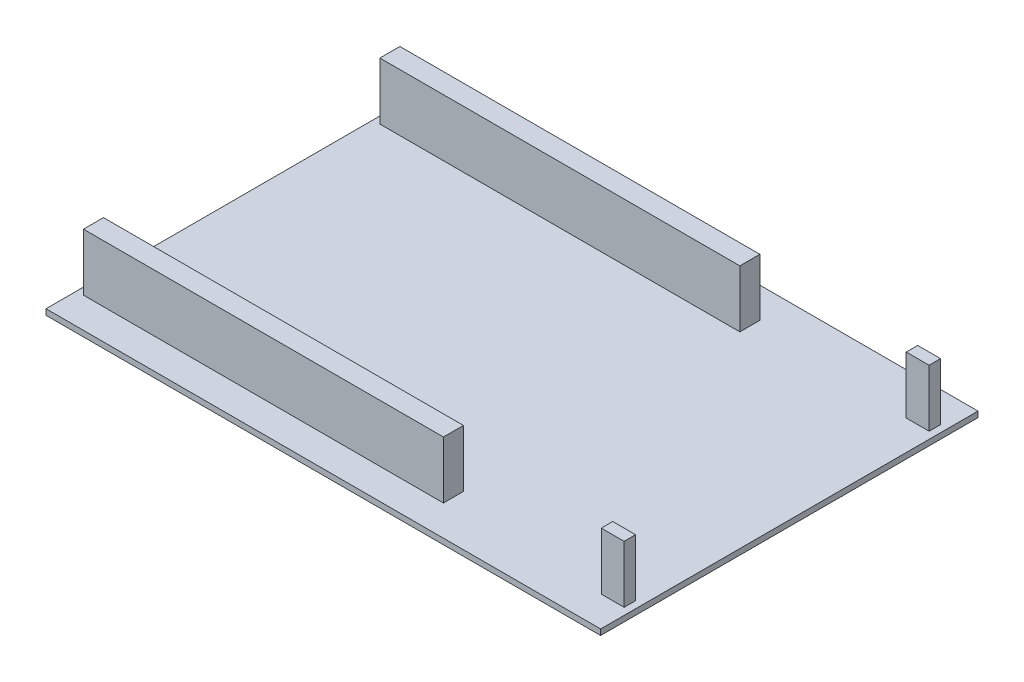
ISO-10303-21;
HEADER;
FILE_DESCRIPTION(('STEP AP214'),'2;1');
FILE_NAME('part.step','',(''),(''),'','','');
FILE_SCHEMA(('AUTOMOTIVE_DESIGN { 1 0 10303 214 1 1 1 1 }'));
ENDSEC;
DATA;
#1=APPLICATION_CONTEXT('core data for automotive mechanical design processes');
#2=APPLICATION_PROTOCOL_DEFINITION('international standard','automotive_design',2000,#1);
#3=PRODUCT_CONTEXT('',#1,'mechanical');
#4=PRODUCT('Part','Part','',(#3));
#5=PRODUCT_RELATED_PRODUCT_CATEGORY('part','',(#4));
#6=PRODUCT_DEFINITION_FORMATION('','',#4);
#7=PRODUCT_DEFINITION_CONTEXT('part definition',#1,'design');
#8=PRODUCT_DEFINITION('design','',#6,#7);
#9=PRODUCT_DEFINITION_SHAPE('','',#8);
#10=(LENGTH_UNIT() NAMED_UNIT(*) SI_UNIT(.MILLI.,.METRE.));
#11=(NAMED_UNIT(*) PLANE_ANGLE_UNIT() SI_UNIT($,.RADIAN.));
#12=(NAMED_UNIT(*) SI_UNIT($,.STERADIAN.) SOLID_ANGLE_UNIT());
#13=UNCERTAINTY_MEASURE_WITH_UNIT(LENGTH_MEASURE(1.E-05),#10,'distance_accuracy_value','');
#14=(GEOMETRIC_REPRESENTATION_CONTEXT(3) GLOBAL_UNCERTAINTY_ASSIGNED_CONTEXT((#13)) GLOBAL_UNIT_ASSIGNED_CONTEXT((#10,
#11,#12)) REPRESENTATION_CONTEXT('',''));
#15=CARTESIAN_POINT('',(0.,0.,0.));
#16=DIRECTION('',(0.,0.,1.));
#17=DIRECTION('',(1.,0.,0.));
#18=AXIS2_PLACEMENT_3D('',#15,#16,#17);
#19=CARTESIAN_POINT('',(0.,1.,0.));
#20=DIRECTION('',(0.,-1.,0.));
#21=DIRECTION('',(0.,0.,-1.));
#22=AXIS2_PLACEMENT_3D('',#19,#20,#21);
#23=PLANE('',#22);
#24=DIRECTION('',(0.,0.,1.));
#25=VECTOR('',#24,1.);
#26=CARTESIAN_POINT('',(43.28,1.,-27.67));
#27=LINE('',#26,#25);
#28=CARTESIAN_POINT('',(43.28,1.,-27.67));
#29=VERTEX_POINT('',#28);
#30=CARTESIAN_POINT('',(43.28,1.,-25.67));
#31=VERTEX_POINT('',#30);
#32=EDGE_CURVE('E227',#29,#31,#27,.T.);
#33=ORIENTED_EDGE('',*,*,#32,.F.);
#34=DIRECTION('',(-1.,0.,0.));
#35=VECTOR('',#34,1.);
#36=CARTESIAN_POINT('',(47.28,1.,-27.67));
#37=LINE('',#36,#35);
#38=CARTESIAN_POINT('',(47.28,1.,-27.67));
#39=VERTEX_POINT('',#38);
#40=EDGE_CURVE('E240',#39,#29,#37,.T.);
#41=ORIENTED_EDGE('',*,*,#40,.F.);
#42=DIRECTION('',(0.,0.,-1.));
#43=VECTOR('',#42,1.);
#44=CARTESIAN_POINT('',(47.28,1.,-27.67));
#45=LINE('',#44,#43);
#46=CARTESIAN_POINT('',(47.28,1.,-25.67));
#47=VERTEX_POINT('',#46);
#48=EDGE_CURVE('E249',#47,#39,#45,.T.);
#49=ORIENTED_EDGE('',*,*,#48,.F.);
#50=DIRECTION('',(1.,0.,0.));
#51=VECTOR('',#50,1.);
#52=CARTESIAN_POINT('',(47.28,1.,-25.67));
#53=LINE('',#52,#51);
#54=EDGE_CURVE('E230',#31,#47,#53,.T.);
#55=ORIENTED_EDGE('',*,*,#54,.F.);
#56=EDGE_LOOP('',(#33,#41,#49,#55));
#57=FACE_BOUND('',#56,.T.);
#58=DIRECTION('',(0.,0.,1.));
#59=VECTOR('',#58,1.);
#60=CARTESIAN_POINT('',(-47.28,1.,-24.17));
#61=LINE('',#60,#59);
#62=CARTESIAN_POINT('',(-47.28,1.,-27.67));
#63=VERTEX_POINT('',#62);
#64=CARTESIAN_POINT('',(-47.28,1.,-24.17));
#65=VERTEX_POINT('',#64);
#66=EDGE_CURVE('E329',#63,#65,#61,.T.);
#67=ORIENTED_EDGE('',*,*,#66,.F.);
#68=DIRECTION('',(-1.,0.,0.));
#69=VECTOR('',#68,1.);
#70=CARTESIAN_POINT('',(15.68,1.,-27.67));
#71=LINE('',#70,#69);
#72=CARTESIAN_POINT('',(15.68,1.,-27.67));
#73=VERTEX_POINT('',#72);
#74=EDGE_CURVE('E334',#73,#63,#71,.T.);
#75=ORIENTED_EDGE('',*,*,#74,.F.);
#76=DIRECTION('',(0.,0.,-1.));
#77=VECTOR('',#76,1.);
#78=CARTESIAN_POINT('',(15.68,1.,-24.17));
#79=LINE('',#78,#77);
#80=CARTESIAN_POINT('',(15.68,1.,-24.17));
#81=VERTEX_POINT('',#80);
#82=EDGE_CURVE('E346',#81,#73,#79,.T.);
#83=ORIENTED_EDGE('',*,*,#82,.F.);
#84=DIRECTION('',(1.,0.,0.));
#85=VECTOR('',#84,1.);
#86=CARTESIAN_POINT('',(15.68,1.,-24.17));
#87=LINE('',#86,#85);
#88=EDGE_CURVE('E343',#65,#81,#87,.T.);
#89=ORIENTED_EDGE('',*,*,#88,.F.);
#90=EDGE_LOOP('',(#67,#75,#83,#89));
#91=FACE_BOUND('',#90,.T.);
#92=DIRECTION('',(0.,0.,-1.));
#93=VECTOR('',#92,1.);
#94=CARTESIAN_POINT('',(48.5,1.,33.));
#95=LINE('',#94,#93);
#96=CARTESIAN_POINT('',(48.5,1.,33.));
#97=VERTEX_POINT('',#96);
#98=CARTESIAN_POINT('',(48.5,1.,-33.));
#99=VERTEX_POINT('',#98);
#100=EDGE_CURVE('E363',#97,#99,#95,.T.);
#101=ORIENTED_EDGE('',*,*,#100,.T.);
#102=DIRECTION('',(-1.,0.,0.));
#103=VECTOR('',#102,1.);
#104=CARTESIAN_POINT('',(-48.5,1.,-33.));
#105=LINE('',#104,#103);
#106=CARTESIAN_POINT('',(-48.5,1.,-33.));
#107=VERTEX_POINT('',#106);
#108=EDGE_CURVE('E366',#99,#107,#105,.T.);
#109=ORIENTED_EDGE('',*,*,#108,.T.);
#110=DIRECTION('',(0.,0.,1.));
#111=VECTOR('',#110,1.);
#112=CARTESIAN_POINT('',(-48.5,1.,33.));
#113=LINE('',#112,#111);
#114=CARTESIAN_POINT('',(-48.5,1.,33.));
#115=VERTEX_POINT('',#114);
#116=EDGE_CURVE('E369',#107,#115,#113,.T.);
#117=ORIENTED_EDGE('',*,*,#116,.T.);
#118=DIRECTION('',(1.,0.,0.));
#119=VECTOR('',#118,1.);
#120=CARTESIAN_POINT('',(-48.5,1.,33.));
#121=LINE('',#120,#119);
#122=EDGE_CURVE('E371',#115,#97,#121,.T.);
#123=ORIENTED_EDGE('',*,*,#122,.T.);
#124=EDGE_LOOP('',(#101,#109,#117,#123));
#125=FACE_BOUND('',#124,.T.);
#126=DIRECTION('',(0.,0.,-1.));
#127=VECTOR('',#126,1.);
#128=CARTESIAN_POINT('',(15.68,1.,24.17));
#129=LINE('',#128,#127);
#130=CARTESIAN_POINT('',(15.68,1.,27.67));
#131=VERTEX_POINT('',#130);
#132=CARTESIAN_POINT('',(15.68,1.,24.17));
#133=VERTEX_POINT('',#132);
#134=EDGE_CURVE('E296',#131,#133,#129,.T.);
#135=ORIENTED_EDGE('',*,*,#134,.F.);
#136=DIRECTION('',(1.,0.,0.));
#137=VECTOR('',#136,1.);
#138=CARTESIAN_POINT('',(15.68,1.,27.67));
#139=LINE('',#138,#137);
#140=CARTESIAN_POINT('',(-47.28,1.,27.67));
#141=VERTEX_POINT('',#140);
#142=EDGE_CURVE('E301',#141,#131,#139,.T.);
#143=ORIENTED_EDGE('',*,*,#142,.F.);
#144=DIRECTION('',(0.,0.,1.));
#145=VECTOR('',#144,1.);
#146=CARTESIAN_POINT('',(-47.28,1.,24.17));
#147=LINE('',#146,#145);
#148=CARTESIAN_POINT('',(-47.28,1.,24.17));
#149=VERTEX_POINT('',#148);
#150=EDGE_CURVE('E313',#149,#141,#147,.T.);
#151=ORIENTED_EDGE('',*,*,#150,.F.);
#152=DIRECTION('',(-1.,0.,0.));
#153=VECTOR('',#152,1.);
#154=CARTESIAN_POINT('',(15.68,1.,24.17));
#155=LINE('',#154,#153);
#156=EDGE_CURVE('E310',#133,#149,#155,.T.);
#157=ORIENTED_EDGE('',*,*,#156,.F.);
#158=EDGE_LOOP('',(#135,#143,#151,#157));
#159=FACE_BOUND('',#158,.T.);
#160=DIRECTION('',(0.,0.,-1.));
#161=VECTOR('',#160,1.);
#162=CARTESIAN_POINT('',(47.28,1.,27.67));
#163=LINE('',#162,#161);
#164=CARTESIAN_POINT('',(47.28,1.,27.67));
#165=VERTEX_POINT('',#164);
#166=CARTESIAN_POINT('',(47.28,1.,25.67));
#167=VERTEX_POINT('',#166);
#168=EDGE_CURVE('E226',#165,#167,#163,.T.);
#169=ORIENTED_EDGE('',*,*,#168,.F.);
#170=DIRECTION('',(1.,0.,0.));
#171=VECTOR('',#170,1.);
#172=CARTESIAN_POINT('',(47.28,1.,27.67));
#173=LINE('',#172,#171);
#174=CARTESIAN_POINT('',(43.28,1.,27.67));
#175=VERTEX_POINT('',#174);
#176=EDGE_CURVE('E223',#175,#165,#173,.T.);
#177=ORIENTED_EDGE('',*,*,#176,.F.);
#178=DIRECTION('',(0.,0.,1.));
#179=VECTOR('',#178,1.);
#180=CARTESIAN_POINT('',(43.28,1.,27.67));
#181=LINE('',#180,#179);
#182=CARTESIAN_POINT('',(43.28,1.,25.67));
#183=VERTEX_POINT('',#182);
#184=EDGE_CURVE('E59',#183,#175,#181,.T.);
#185=ORIENTED_EDGE('',*,*,#184,.F.);
#186=DIRECTION('',(-1.,0.,0.));
#187=VECTOR('',#186,1.);
#188=CARTESIAN_POINT('',(47.28,1.,25.67));
#189=LINE('',#188,#187);
#190=EDGE_CURVE('E54',#167,#183,#189,.T.);
#191=ORIENTED_EDGE('',*,*,#190,.F.);
#192=EDGE_LOOP('',(#169,#177,#185,#191));
#193=FACE_BOUND('',#192,.T.);
#194=ADVANCED_FACE('F37',(#57,#91,#125,#159,#193),#23,.F.);
#195=CARTESIAN_POINT('',(48.5,1.,33.));
#196=DIRECTION('',(-1.,0.,0.));
#197=DIRECTION('',(0.,0.,1.));
#198=AXIS2_PLACEMENT_3D('',#195,#196,#197);
#199=PLANE('',#198);
#200=DIRECTION('',(0.,0.,-1.));
#201=VECTOR('',#200,1.);
#202=CARTESIAN_POINT('',(48.5,0.,33.));
#203=LINE('',#202,#201);
#204=CARTESIAN_POINT('',(48.5,0.,33.));
#205=VERTEX_POINT('',#204);
#206=CARTESIAN_POINT('',(48.5,0.,-33.));
#207=VERTEX_POINT('',#206);
#208=EDGE_CURVE('E362',#205,#207,#203,.T.);
#209=ORIENTED_EDGE('',*,*,#208,.T.);
#210=DIRECTION('',(0.,-1.,0.));
#211=VECTOR('',#210,1.);
#212=CARTESIAN_POINT('',(48.5,1.,-33.));
#213=LINE('',#212,#211);
#214=EDGE_CURVE('E41',#99,#207,#213,.T.);
#215=ORIENTED_EDGE('',*,*,#214,.F.);
#216=ORIENTED_EDGE('',*,*,#100,.F.);
#217=DIRECTION('',(0.,-1.,0.));
#218=VECTOR('',#217,1.);
#219=CARTESIAN_POINT('',(48.5,1.,33.));
#220=LINE('',#219,#218);
#221=EDGE_CURVE('E373',#97,#205,#220,.T.);
#222=ORIENTED_EDGE('',*,*,#221,.T.);
#223=EDGE_LOOP('',(#209,#215,#216,#222));
#224=FACE_BOUND('',#223,.T.);
#225=ADVANCED_FACE('F39',(#224),#199,.F.);
#226=CARTESIAN_POINT('',(-48.5,1.,-33.));
#227=DIRECTION('',(0.,0.,1.));
#228=DIRECTION('',(1.,0.,0.));
#229=AXIS2_PLACEMENT_3D('',#226,#227,#228);
#230=PLANE('',#229);
#231=DIRECTION('',(-1.,0.,0.));
#232=VECTOR('',#231,1.);
#233=CARTESIAN_POINT('',(-48.5,0.,-33.));
#234=LINE('',#233,#232);
#235=CARTESIAN_POINT('',(-48.5,0.,-33.));
#236=VERTEX_POINT('',#235);
#237=EDGE_CURVE('E376',#207,#236,#234,.T.);
#238=ORIENTED_EDGE('',*,*,#237,.T.);
#239=DIRECTION('',(0.,-1.,0.));
#240=VECTOR('',#239,1.);
#241=CARTESIAN_POINT('',(-48.5,1.,-33.));
#242=LINE('',#241,#240);
#243=EDGE_CURVE('E388',#107,#236,#242,.T.);
#244=ORIENTED_EDGE('',*,*,#243,.F.);
#245=ORIENTED_EDGE('',*,*,#108,.F.);
#246=ORIENTED_EDGE('',*,*,#214,.T.);
#247=EDGE_LOOP('',(#238,#244,#245,#246));
#248=FACE_BOUND('',#247,.T.);
#249=ADVANCED_FACE('F397',(#248),#230,.F.);
#250=CARTESIAN_POINT('',(-48.5,1.,33.));
#251=DIRECTION('',(1.,0.,0.));
#252=DIRECTION('',(0.,0.,-1.));
#253=AXIS2_PLACEMENT_3D('',#250,#251,#252);
#254=PLANE('',#253);
#255=DIRECTION('',(0.,0.,1.));
#256=VECTOR('',#255,1.);
#257=CARTESIAN_POINT('',(-48.5,0.,33.));
#258=LINE('',#257,#256);
#259=CARTESIAN_POINT('',(-48.5,0.,14.34));
#260=VERTEX_POINT('',#259);
#261=EDGE_CURVE('E379',#236,#260,#258,.T.);
#262=ORIENTED_EDGE('',*,*,#261,.T.);
#263=CARTESIAN_POINT('',(-48.5,0.,20.34));
#264=VERTEX_POINT('',#263);
#265=EDGE_CURVE('E382',#260,#264,#258,.T.);
#266=ORIENTED_EDGE('',*,*,#265,.T.);
#267=CARTESIAN_POINT('',(-48.5,0.,33.));
#268=VERTEX_POINT('',#267);
#269=EDGE_CURVE('E378',#264,#268,#258,.T.);
#270=ORIENTED_EDGE('',*,*,#269,.T.);
#271=DIRECTION('',(0.,-1.,0.));
#272=VECTOR('',#271,1.);
#273=CARTESIAN_POINT('',(-48.5,1.,33.));
#274=LINE('',#273,#272);
#275=EDGE_CURVE('E386',#115,#268,#274,.T.);
#276=ORIENTED_EDGE('',*,*,#275,.F.);
#277=ORIENTED_EDGE('',*,*,#116,.F.);
#278=ORIENTED_EDGE('',*,*,#243,.T.);
#279=EDGE_LOOP('',(#262,#266,#270,#276,#277,#278));
#280=FACE_BOUND('',#279,.T.);
#281=ADVANCED_FACE('F407',(#280),#254,.F.);
#282=CARTESIAN_POINT('',(-48.5,1.,33.));
#283=DIRECTION('',(0.,0.,-1.));
#284=DIRECTION('',(-1.,0.,0.));
#285=AXIS2_PLACEMENT_3D('',#282,#283,#284);
#286=PLANE('',#285);
#287=DIRECTION('',(1.,0.,0.));
#288=VECTOR('',#287,1.);
#289=CARTESIAN_POINT('',(-48.5,0.,33.));
#290=LINE('',#289,#288);
#291=EDGE_CURVE('E367',#268,#205,#290,.T.);
#292=ORIENTED_EDGE('',*,*,#291,.T.);
#293=ORIENTED_EDGE('',*,*,#221,.F.);
#294=ORIENTED_EDGE('',*,*,#122,.F.);
#295=ORIENTED_EDGE('',*,*,#275,.T.);
#296=EDGE_LOOP('',(#292,#293,#294,#295));
#297=FACE_BOUND('',#296,.T.);
#298=ADVANCED_FACE('F428',(#297),#286,.F.);
#299=CARTESIAN_POINT('',(0.,0.,0.));
#300=DIRECTION('',(0.,-1.,0.));
#301=DIRECTION('',(0.,0.,-1.));
#302=AXIS2_PLACEMENT_3D('',#299,#300,#301);
#303=PLANE('',#302);
#304=DIRECTION('',(1.,0.,0.));
#305=VECTOR('',#304,1.);
#306=CARTESIAN_POINT('',(-51.5,0.,14.34));
#307=LINE('',#306,#305);
#308=CARTESIAN_POINT('',(-42.5,0.,14.34));
#309=VERTEX_POINT('',#308);
#310=EDGE_CURVE('E11',#260,#309,#307,.T.);
#311=ORIENTED_EDGE('',*,*,#310,.F.);
#312=ORIENTED_EDGE('',*,*,#261,.F.);
#313=ORIENTED_EDGE('',*,*,#237,.F.);
#314=ORIENTED_EDGE('',*,*,#208,.F.);
#315=ORIENTED_EDGE('',*,*,#291,.F.);
#316=ORIENTED_EDGE('',*,*,#269,.F.);
#317=DIRECTION('',(-1.,0.,0.));
#318=VECTOR('',#317,1.);
#319=CARTESIAN_POINT('',(-51.5,0.,20.34));
#320=LINE('',#319,#318);
#321=CARTESIAN_POINT('',(-42.5,0.,20.34));
#322=VERTEX_POINT('',#321);
#323=EDGE_CURVE('E279',#322,#264,#320,.T.);
#324=ORIENTED_EDGE('',*,*,#323,.F.);
#325=DIRECTION('',(0.,0.,1.));
#326=VECTOR('',#325,1.);
#327=CARTESIAN_POINT('',(-42.5,0.,14.34));
#328=LINE('',#327,#326);
#329=EDGE_CURVE('E265',#309,#322,#328,.T.);
#330=ORIENTED_EDGE('',*,*,#329,.F.);
#331=EDGE_LOOP('',(#311,#312,#313,#314,#315,#316,#324,#330));
#332=FACE_BOUND('',#331,.T.);
#333=ADVANCED_FACE('F404',(#332),#303,.T.);
#334=CARTESIAN_POINT('',(-47.28,11.,-24.17));
#335=DIRECTION('',(1.,0.,0.));
#336=DIRECTION('',(0.,0.,-1.));
#337=AXIS2_PLACEMENT_3D('',#334,#335,#336);
#338=PLANE('',#337);
#339=ORIENTED_EDGE('',*,*,#66,.T.);
#340=DIRECTION('',(0.,-1.,0.));
#341=VECTOR('',#340,1.);
#342=CARTESIAN_POINT('',(-47.28,11.,-24.17));
#343=LINE('',#342,#341);
#344=CARTESIAN_POINT('',(-47.28,11.,-24.17));
#345=VERTEX_POINT('',#344);
#346=EDGE_CURVE('E359',#345,#65,#343,.T.);
#347=ORIENTED_EDGE('',*,*,#346,.F.);
#348=DIRECTION('',(0.,0.,1.));
#349=VECTOR('',#348,1.);
#350=CARTESIAN_POINT('',(-47.28,11.,-24.17));
#351=LINE('',#350,#349);
#352=CARTESIAN_POINT('',(-47.28,11.,-27.67));
#353=VERTEX_POINT('',#352);
#354=EDGE_CURVE('E330',#353,#345,#351,.T.);
#355=ORIENTED_EDGE('',*,*,#354,.F.);
#356=DIRECTION('',(0.,-1.,0.));
#357=VECTOR('',#356,1.);
#358=CARTESIAN_POINT('',(-47.28,11.,-27.67));
#359=LINE('',#358,#357);
#360=EDGE_CURVE('E340',#353,#63,#359,.T.);
#361=ORIENTED_EDGE('',*,*,#360,.T.);
#362=EDGE_LOOP('',(#339,#347,#355,#361));
#363=FACE_BOUND('',#362,.T.);
#364=ADVANCED_FACE('F532',(#363),#338,.F.);
#365=CARTESIAN_POINT('',(15.68,11.,-24.17));
#366=DIRECTION('',(0.,0.,-1.));
#367=DIRECTION('',(-1.,0.,0.));
#368=AXIS2_PLACEMENT_3D('',#365,#366,#367);
#369=PLANE('',#368);
#370=ORIENTED_EDGE('',*,*,#88,.T.);
#371=DIRECTION('',(0.,-1.,0.));
#372=VECTOR('',#371,1.);
#373=CARTESIAN_POINT('',(15.68,11.,-24.17));
#374=LINE('',#373,#372);
#375=CARTESIAN_POINT('',(15.68,11.,-24.17));
#376=VERTEX_POINT('',#375);
#377=EDGE_CURVE('E356',#376,#81,#374,.T.);
#378=ORIENTED_EDGE('',*,*,#377,.F.);
#379=DIRECTION('',(1.,0.,0.));
#380=VECTOR('',#379,1.);
#381=CARTESIAN_POINT('',(15.68,11.,-24.17));
#382=LINE('',#381,#380);
#383=EDGE_CURVE('E333',#345,#376,#382,.T.);
#384=ORIENTED_EDGE('',*,*,#383,.F.);
#385=ORIENTED_EDGE('',*,*,#346,.T.);
#386=EDGE_LOOP('',(#370,#378,#384,#385));
#387=FACE_BOUND('',#386,.T.);
#388=ADVANCED_FACE('F528',(#387),#369,.F.);
#389=CARTESIAN_POINT('',(15.68,11.,-24.17));
#390=DIRECTION('',(-1.,0.,0.));
#391=DIRECTION('',(0.,0.,1.));
#392=AXIS2_PLACEMENT_3D('',#389,#390,#391);
#393=PLANE('',#392);
#394=ORIENTED_EDGE('',*,*,#82,.T.);
#395=DIRECTION('',(0.,-1.,0.));
#396=VECTOR('',#395,1.);
#397=CARTESIAN_POINT('',(15.68,11.,-27.67));
#398=LINE('',#397,#396);
#399=CARTESIAN_POINT('',(15.68,11.,-27.67));
#400=VERTEX_POINT('',#399);
#401=EDGE_CURVE('E353',#400,#73,#398,.T.);
#402=ORIENTED_EDGE('',*,*,#401,.F.);
#403=DIRECTION('',(0.,0.,-1.));
#404=VECTOR('',#403,1.);
#405=CARTESIAN_POINT('',(15.68,11.,-24.17));
#406=LINE('',#405,#404);
#407=EDGE_CURVE('E336',#376,#400,#406,.T.);
#408=ORIENTED_EDGE('',*,*,#407,.F.);
#409=ORIENTED_EDGE('',*,*,#377,.T.);
#410=EDGE_LOOP('',(#394,#402,#408,#409));
#411=FACE_BOUND('',#410,.T.);
#412=ADVANCED_FACE('F524',(#411),#393,.F.);
#413=CARTESIAN_POINT('',(15.68,11.,-27.67));
#414=DIRECTION('',(0.,0.,1.));
#415=DIRECTION('',(1.,0.,0.));
#416=AXIS2_PLACEMENT_3D('',#413,#414,#415);
#417=PLANE('',#416);
#418=ORIENTED_EDGE('',*,*,#74,.T.);
#419=ORIENTED_EDGE('',*,*,#360,.F.);
#420=DIRECTION('',(-1.,0.,0.));
#421=VECTOR('',#420,1.);
#422=CARTESIAN_POINT('',(15.68,11.,-27.67));
#423=LINE('',#422,#421);
#424=EDGE_CURVE('E338',#400,#353,#423,.T.);
#425=ORIENTED_EDGE('',*,*,#424,.F.);
#426=ORIENTED_EDGE('',*,*,#401,.T.);
#427=EDGE_LOOP('',(#418,#419,#425,#426));
#428=FACE_BOUND('',#427,.T.);
#429=ADVANCED_FACE('F520',(#428),#417,.F.);
#430=CARTESIAN_POINT('',(0.,11.,0.));
#431=DIRECTION('',(0.,1.,0.));
#432=DIRECTION('',(0.,0.,1.));
#433=AXIS2_PLACEMENT_3D('',#430,#431,#432);
#434=PLANE('',#433);
#435=ORIENTED_EDGE('',*,*,#354,.T.);
#436=ORIENTED_EDGE('',*,*,#383,.T.);
#437=ORIENTED_EDGE('',*,*,#407,.T.);
#438=ORIENTED_EDGE('',*,*,#424,.T.);
#439=EDGE_LOOP('',(#435,#436,#437,#438));
#440=FACE_BOUND('',#439,.T.);
#441=ADVANCED_FACE('F516',(#440),#434,.T.);
#442=CARTESIAN_POINT('',(15.68,11.,24.17));
#443=DIRECTION('',(-1.,0.,0.));
#444=DIRECTION('',(0.,0.,1.));
#445=AXIS2_PLACEMENT_3D('',#442,#443,#444);
#446=PLANE('',#445);
#447=ORIENTED_EDGE('',*,*,#134,.T.);
#448=DIRECTION('',(0.,-1.,0.));
#449=VECTOR('',#448,1.);
#450=CARTESIAN_POINT('',(15.68,11.,24.17));
#451=LINE('',#450,#449);
#452=CARTESIAN_POINT('',(15.68,11.,24.17));
#453=VERTEX_POINT('',#452);
#454=EDGE_CURVE('E326',#453,#133,#451,.T.);
#455=ORIENTED_EDGE('',*,*,#454,.F.);
#456=DIRECTION('',(0.,0.,-1.));
#457=VECTOR('',#456,1.);
#458=CARTESIAN_POINT('',(15.68,11.,24.17));
#459=LINE('',#458,#457);
#460=CARTESIAN_POINT('',(15.68,11.,27.67));
#461=VERTEX_POINT('',#460);
#462=EDGE_CURVE('E297',#461,#453,#459,.T.);
#463=ORIENTED_EDGE('',*,*,#462,.F.);
#464=DIRECTION('',(0.,-1.,0.));
#465=VECTOR('',#464,1.);
#466=CARTESIAN_POINT('',(15.68,11.,27.67));
#467=LINE('',#466,#465);
#468=EDGE_CURVE('E307',#461,#131,#467,.T.);
#469=ORIENTED_EDGE('',*,*,#468,.T.);
#470=EDGE_LOOP('',(#447,#455,#463,#469));
#471=FACE_BOUND('',#470,.T.);
#472=ADVANCED_FACE('F512',(#471),#446,.F.);
#473=CARTESIAN_POINT('',(15.68,11.,24.17));
#474=DIRECTION('',(0.,0.,1.));
#475=DIRECTION('',(1.,0.,0.));
#476=AXIS2_PLACEMENT_3D('',#473,#474,#475);
#477=PLANE('',#476);
#478=ORIENTED_EDGE('',*,*,#156,.T.);
#479=DIRECTION('',(0.,-1.,0.));
#480=VECTOR('',#479,1.);
#481=CARTESIAN_POINT('',(-47.28,11.,24.17));
#482=LINE('',#481,#480);
#483=CARTESIAN_POINT('',(-47.28,11.,24.17));
#484=VERTEX_POINT('',#483);
#485=EDGE_CURVE('E323',#484,#149,#482,.T.);
#486=ORIENTED_EDGE('',*,*,#485,.F.);
#487=DIRECTION('',(-1.,0.,0.));
#488=VECTOR('',#487,1.);
#489=CARTESIAN_POINT('',(15.68,11.,24.17));
#490=LINE('',#489,#488);
#491=EDGE_CURVE('E300',#453,#484,#490,.T.);
#492=ORIENTED_EDGE('',*,*,#491,.F.);
#493=ORIENTED_EDGE('',*,*,#454,.T.);
#494=EDGE_LOOP('',(#478,#486,#492,#493));
#495=FACE_BOUND('',#494,.T.);
#496=ADVANCED_FACE('F508',(#495),#477,.F.);
#497=CARTESIAN_POINT('',(-47.28,11.,24.17));
#498=DIRECTION('',(1.,0.,0.));
#499=DIRECTION('',(0.,0.,-1.));
#500=AXIS2_PLACEMENT_3D('',#497,#498,#499);
#501=PLANE('',#500);
#502=ORIENTED_EDGE('',*,*,#150,.T.);
#503=DIRECTION('',(0.,-1.,0.));
#504=VECTOR('',#503,1.);
#505=CARTESIAN_POINT('',(-47.28,11.,27.67));
#506=LINE('',#505,#504);
#507=CARTESIAN_POINT('',(-47.28,11.,27.67));
#508=VERTEX_POINT('',#507);
#509=EDGE_CURVE('E320',#508,#141,#506,.T.);
#510=ORIENTED_EDGE('',*,*,#509,.F.);
#511=DIRECTION('',(0.,0.,1.));
#512=VECTOR('',#511,1.);
#513=CARTESIAN_POINT('',(-47.28,11.,24.17));
#514=LINE('',#513,#512);
#515=EDGE_CURVE('E303',#484,#508,#514,.T.);
#516=ORIENTED_EDGE('',*,*,#515,.F.);
#517=ORIENTED_EDGE('',*,*,#485,.T.);
#518=EDGE_LOOP('',(#502,#510,#516,#517));
#519=FACE_BOUND('',#518,.T.);
#520=ADVANCED_FACE('F504',(#519),#501,.F.);
#521=CARTESIAN_POINT('',(15.68,11.,27.67));
#522=DIRECTION('',(0.,0.,-1.));
#523=DIRECTION('',(-1.,0.,0.));
#524=AXIS2_PLACEMENT_3D('',#521,#522,#523);
#525=PLANE('',#524);
#526=ORIENTED_EDGE('',*,*,#142,.T.);
#527=ORIENTED_EDGE('',*,*,#468,.F.);
#528=DIRECTION('',(1.,0.,0.));
#529=VECTOR('',#528,1.);
#530=CARTESIAN_POINT('',(15.68,11.,27.67));
#531=LINE('',#530,#529);
#532=EDGE_CURVE('E305',#508,#461,#531,.T.);
#533=ORIENTED_EDGE('',*,*,#532,.F.);
#534=ORIENTED_EDGE('',*,*,#509,.T.);
#535=EDGE_LOOP('',(#526,#527,#533,#534));
#536=FACE_BOUND('',#535,.T.);
#537=ADVANCED_FACE('F500',(#536),#525,.F.);
#538=CARTESIAN_POINT('',(0.,11.,0.));
#539=DIRECTION('',(0.,-1.,0.));
#540=DIRECTION('',(0.,0.,-1.));
#541=AXIS2_PLACEMENT_3D('',#538,#539,#540);
#542=PLANE('',#541);
#543=ORIENTED_EDGE('',*,*,#462,.T.);
#544=ORIENTED_EDGE('',*,*,#491,.T.);
#545=ORIENTED_EDGE('',*,*,#515,.T.);
#546=ORIENTED_EDGE('',*,*,#532,.T.);
#547=EDGE_LOOP('',(#543,#544,#545,#546));
#548=FACE_BOUND('',#547,.T.);
#549=ADVANCED_FACE('F488',(#548),#542,.F.);
#550=CARTESIAN_POINT('',(0.,0.,0.));
#551=DIRECTION('',(0.,1.,0.));
#552=DIRECTION('',(0.,0.,1.));
#553=AXIS2_PLACEMENT_3D('',#550,#551,#552);
#554=PLANE('',#553);
#555=ORIENTED_EDGE('',*,*,#265,.F.);
#556=CARTESIAN_POINT('',(-51.5,0.,14.34));
#557=VERTEX_POINT('',#556);
#558=EDGE_CURVE('E47',#557,#260,#307,.T.);
#559=ORIENTED_EDGE('',*,*,#558,.F.);
#560=DIRECTION('',(0.,0.,-1.));
#561=VECTOR('',#560,1.);
#562=CARTESIAN_POINT('',(-51.5,0.,14.34));
#563=LINE('',#562,#561);
#564=CARTESIAN_POINT('',(-51.5,0.,20.34));
#565=VERTEX_POINT('',#564);
#566=EDGE_CURVE('E282',#565,#557,#563,.T.);
#567=ORIENTED_EDGE('',*,*,#566,.F.);
#568=EDGE_CURVE('E278',#264,#565,#320,.T.);
#569=ORIENTED_EDGE('',*,*,#568,.F.);
#570=EDGE_LOOP('',(#555,#559,#567,#569));
#571=FACE_BOUND('',#570,.T.);
#572=ADVANCED_FACE('F411',(#571),#554,.T.);
#573=CARTESIAN_POINT('',(-42.5,-10.,14.34));
#574=DIRECTION('',(-1.,0.,0.));
#575=DIRECTION('',(0.,0.,1.));
#576=AXIS2_PLACEMENT_3D('',#573,#574,#575);
#577=PLANE('',#576);
#578=ORIENTED_EDGE('',*,*,#329,.T.);
#579=DIRECTION('',(0.,1.,0.));
#580=VECTOR('',#579,1.);
#581=CARTESIAN_POINT('',(-42.5,-10.,20.34));
#582=LINE('',#581,#580);
#583=CARTESIAN_POINT('',(-42.5,-10.,20.34));
#584=VERTEX_POINT('',#583);
#585=EDGE_CURVE('E293',#584,#322,#582,.T.);
#586=ORIENTED_EDGE('',*,*,#585,.F.);
#587=DIRECTION('',(0.,0.,1.));
#588=VECTOR('',#587,1.);
#589=CARTESIAN_POINT('',(-42.5,-10.,14.34));
#590=LINE('',#589,#588);
#591=CARTESIAN_POINT('',(-42.5,-10.,14.34));
#592=VERTEX_POINT('',#591);
#593=EDGE_CURVE('E266',#592,#584,#590,.T.);
#594=ORIENTED_EDGE('',*,*,#593,.F.);
#595=DIRECTION('',(0.,1.,0.));
#596=VECTOR('',#595,1.);
#597=CARTESIAN_POINT('',(-42.5,-10.,14.34));
#598=LINE('',#597,#596);
#599=EDGE_CURVE('E275',#592,#309,#598,.T.);
#600=ORIENTED_EDGE('',*,*,#599,.T.);
#601=EDGE_LOOP('',(#578,#586,#594,#600));
#602=FACE_BOUND('',#601,.T.);
#603=ADVANCED_FACE('F487',(#602),#577,.F.);
#604=CARTESIAN_POINT('',(-51.5,-10.,20.34));
#605=DIRECTION('',(0.,0.,-1.));
#606=DIRECTION('',(-1.,0.,0.));
#607=AXIS2_PLACEMENT_3D('',#604,#605,#606);
#608=PLANE('',#607);
#609=ORIENTED_EDGE('',*,*,#323,.T.);
#610=ORIENTED_EDGE('',*,*,#568,.T.);
#611=DIRECTION('',(0.,1.,0.));
#612=VECTOR('',#611,1.);
#613=CARTESIAN_POINT('',(-51.5,-10.,20.34));
#614=LINE('',#613,#612);
#615=CARTESIAN_POINT('',(-51.5,-10.,20.34));
#616=VERTEX_POINT('',#615);
#617=EDGE_CURVE('E290',#616,#565,#614,.T.);
#618=ORIENTED_EDGE('',*,*,#617,.F.);
#619=DIRECTION('',(-1.,0.,0.));
#620=VECTOR('',#619,1.);
#621=CARTESIAN_POINT('',(-51.5,-10.,20.34));
#622=LINE('',#621,#620);
#623=EDGE_CURVE('E269',#584,#616,#622,.T.);
#624=ORIENTED_EDGE('',*,*,#623,.F.);
#625=ORIENTED_EDGE('',*,*,#585,.T.);
#626=EDGE_LOOP('',(#609,#610,#618,#624,#625));
#627=FACE_BOUND('',#626,.T.);
#628=ADVANCED_FACE('F423',(#627),#608,.F.);
#629=CARTESIAN_POINT('',(-51.5,-10.,14.34));
#630=DIRECTION('',(1.,0.,0.));
#631=DIRECTION('',(0.,0.,-1.));
#632=AXIS2_PLACEMENT_3D('',#629,#630,#631);
#633=PLANE('',#632);
#634=ORIENTED_EDGE('',*,*,#566,.T.);
#635=DIRECTION('',(0.,1.,0.));
#636=VECTOR('',#635,1.);
#637=CARTESIAN_POINT('',(-51.5,-10.,14.34));
#638=LINE('',#637,#636);
#639=CARTESIAN_POINT('',(-51.5,-10.,14.34));
#640=VERTEX_POINT('',#639);
#641=EDGE_CURVE('E287',#640,#557,#638,.T.);
#642=ORIENTED_EDGE('',*,*,#641,.F.);
#643=DIRECTION('',(0.,0.,-1.));
#644=VECTOR('',#643,1.);
#645=CARTESIAN_POINT('',(-51.5,-10.,14.34));
#646=LINE('',#645,#644);
#647=EDGE_CURVE('E271',#616,#640,#646,.T.);
#648=ORIENTED_EDGE('',*,*,#647,.F.);
#649=ORIENTED_EDGE('',*,*,#617,.T.);
#650=EDGE_LOOP('',(#634,#642,#648,#649));
#651=FACE_BOUND('',#650,.T.);
#652=ADVANCED_FACE('F420',(#651),#633,.F.);
#653=CARTESIAN_POINT('',(-51.5,-10.,14.34));
#654=DIRECTION('',(0.,0.,1.));
#655=DIRECTION('',(1.,0.,0.));
#656=AXIS2_PLACEMENT_3D('',#653,#654,#655);
#657=PLANE('',#656);
#658=ORIENTED_EDGE('',*,*,#558,.T.);
#659=ORIENTED_EDGE('',*,*,#310,.T.);
#660=ORIENTED_EDGE('',*,*,#599,.F.);
#661=DIRECTION('',(1.,0.,0.));
#662=VECTOR('',#661,1.);
#663=CARTESIAN_POINT('',(-51.5,-10.,14.34));
#664=LINE('',#663,#662);
#665=EDGE_CURVE('E273',#640,#592,#664,.T.);
#666=ORIENTED_EDGE('',*,*,#665,.F.);
#667=ORIENTED_EDGE('',*,*,#641,.T.);
#668=EDGE_LOOP('',(#658,#659,#660,#666,#667));
#669=FACE_BOUND('',#668,.T.);
#670=ADVANCED_FACE('F414',(#669),#657,.F.);
#671=CARTESIAN_POINT('',(0.,-10.,0.));
#672=DIRECTION('',(0.,1.,0.));
#673=DIRECTION('',(0.,0.,1.));
#674=AXIS2_PLACEMENT_3D('',#671,#672,#673);
#675=PLANE('',#674);
#676=ORIENTED_EDGE('',*,*,#593,.T.);
#677=ORIENTED_EDGE('',*,*,#623,.T.);
#678=ORIENTED_EDGE('',*,*,#647,.T.);
#679=ORIENTED_EDGE('',*,*,#665,.T.);
#680=EDGE_LOOP('',(#676,#677,#678,#679));
#681=FACE_BOUND('',#680,.T.);
#682=ADVANCED_FACE('F480',(#681),#675,.F.);
#683=CARTESIAN_POINT('',(43.28,11.,-27.67));
#684=DIRECTION('',(1.,0.,0.));
#685=DIRECTION('',(0.,0.,-1.));
#686=AXIS2_PLACEMENT_3D('',#683,#684,#685);
#687=PLANE('',#686);
#688=ORIENTED_EDGE('',*,*,#32,.T.);
#689=DIRECTION('',(0.,-1.,0.));
#690=VECTOR('',#689,1.);
#691=CARTESIAN_POINT('',(43.28,11.,-25.67));
#692=LINE('',#691,#690);
#693=CARTESIAN_POINT('',(43.28,11.,-25.67));
#694=VERTEX_POINT('',#693);
#695=EDGE_CURVE('E262',#694,#31,#692,.T.);
#696=ORIENTED_EDGE('',*,*,#695,.F.);
#697=DIRECTION('',(0.,0.,1.));
#698=VECTOR('',#697,1.);
#699=CARTESIAN_POINT('',(43.28,11.,-27.67));
#700=LINE('',#699,#698);
#701=CARTESIAN_POINT('',(43.28,11.,-27.67));
#702=VERTEX_POINT('',#701);
#703=EDGE_CURVE('E236',#702,#694,#700,.T.);
#704=ORIENTED_EDGE('',*,*,#703,.F.);
#705=DIRECTION('',(0.,-1.,0.));
#706=VECTOR('',#705,1.);
#707=CARTESIAN_POINT('',(43.28,11.,-27.67));
#708=LINE('',#707,#706);
#709=EDGE_CURVE('E245',#702,#29,#708,.T.);
#710=ORIENTED_EDGE('',*,*,#709,.T.);
#711=EDGE_LOOP('',(#688,#696,#704,#710));
#712=FACE_BOUND('',#711,.T.);
#713=ADVANCED_FACE('F476',(#712),#687,.F.);
#714=CARTESIAN_POINT('',(47.28,11.,-25.67));
#715=DIRECTION('',(0.,0.,-1.));
#716=DIRECTION('',(-1.,0.,0.));
#717=AXIS2_PLACEMENT_3D('',#714,#715,#716);
#718=PLANE('',#717);
#719=ORIENTED_EDGE('',*,*,#54,.T.);
#720=DIRECTION('',(0.,-1.,0.));
#721=VECTOR('',#720,1.);
#722=CARTESIAN_POINT('',(47.28,11.,-25.67));
#723=LINE('',#722,#721);
#724=CARTESIAN_POINT('',(47.28,11.,-25.67));
#725=VERTEX_POINT('',#724);
#726=EDGE_CURVE('E259',#725,#47,#723,.T.);
#727=ORIENTED_EDGE('',*,*,#726,.F.);
#728=DIRECTION('',(1.,0.,0.));
#729=VECTOR('',#728,1.);
#730=CARTESIAN_POINT('',(47.28,11.,-25.67));
#731=LINE('',#730,#729);
#732=EDGE_CURVE('E239',#694,#725,#731,.T.);
#733=ORIENTED_EDGE('',*,*,#732,.F.);
#734=ORIENTED_EDGE('',*,*,#695,.T.);
#735=EDGE_LOOP('',(#719,#727,#733,#734));
#736=FACE_BOUND('',#735,.T.);
#737=ADVANCED_FACE('F472',(#736),#718,.F.);
#738=CARTESIAN_POINT('',(47.28,11.,-27.67));
#739=DIRECTION('',(-1.,0.,0.));
#740=DIRECTION('',(0.,0.,1.));
#741=AXIS2_PLACEMENT_3D('',#738,#739,#740);
#742=PLANE('',#741);
#743=ORIENTED_EDGE('',*,*,#48,.T.);
#744=DIRECTION('',(0.,-1.,0.));
#745=VECTOR('',#744,1.);
#746=CARTESIAN_POINT('',(47.28,11.,-27.67));
#747=LINE('',#746,#745);
#748=CARTESIAN_POINT('',(47.28,11.,-27.67));
#749=VERTEX_POINT('',#748);
#750=EDGE_CURVE('E256',#749,#39,#747,.T.);
#751=ORIENTED_EDGE('',*,*,#750,.F.);
#752=DIRECTION('',(0.,0.,-1.));
#753=VECTOR('',#752,1.);
#754=CARTESIAN_POINT('',(47.28,11.,-27.67));
#755=LINE('',#754,#753);
#756=EDGE_CURVE('E242',#725,#749,#755,.T.);
#757=ORIENTED_EDGE('',*,*,#756,.F.);
#758=ORIENTED_EDGE('',*,*,#726,.T.);
#759=EDGE_LOOP('',(#743,#751,#757,#758));
#760=FACE_BOUND('',#759,.T.);
#761=ADVANCED_FACE('F468',(#760),#742,.F.);
#762=CARTESIAN_POINT('',(47.28,11.,-27.67));
#763=DIRECTION('',(0.,0.,1.));
#764=DIRECTION('',(1.,0.,0.));
#765=AXIS2_PLACEMENT_3D('',#762,#763,#764);
#766=PLANE('',#765);
#767=ORIENTED_EDGE('',*,*,#40,.T.);
#768=ORIENTED_EDGE('',*,*,#709,.F.);
#769=DIRECTION('',(-1.,0.,0.));
#770=VECTOR('',#769,1.);
#771=CARTESIAN_POINT('',(47.28,11.,-27.67));
#772=LINE('',#771,#770);
#773=EDGE_CURVE('E244',#749,#702,#772,.T.);
#774=ORIENTED_EDGE('',*,*,#773,.F.);
#775=ORIENTED_EDGE('',*,*,#750,.T.);
#776=EDGE_LOOP('',(#767,#768,#774,#775));
#777=FACE_BOUND('',#776,.T.);
#778=ADVANCED_FACE('F464',(#777),#766,.F.);
#779=CARTESIAN_POINT('',(0.,11.,0.));
#780=DIRECTION('',(0.,-1.,0.));
#781=DIRECTION('',(0.,0.,-1.));
#782=AXIS2_PLACEMENT_3D('',#779,#780,#781);
#783=PLANE('',#782);
#784=ORIENTED_EDGE('',*,*,#703,.T.);
#785=ORIENTED_EDGE('',*,*,#732,.T.);
#786=ORIENTED_EDGE('',*,*,#756,.T.);
#787=ORIENTED_EDGE('',*,*,#773,.T.);
#788=EDGE_LOOP('',(#784,#785,#786,#787));
#789=FACE_BOUND('',#788,.T.);
#790=ADVANCED_FACE('F461',(#789),#783,.F.);
#791=CARTESIAN_POINT('',(47.28,11.,27.67));
#792=DIRECTION('',(-1.,0.,0.));
#793=DIRECTION('',(0.,0.,1.));
#794=AXIS2_PLACEMENT_3D('',#791,#792,#793);
#795=PLANE('',#794);
#796=ORIENTED_EDGE('',*,*,#168,.T.);
#797=DIRECTION('',(0.,-1.,0.));
#798=VECTOR('',#797,1.);
#799=CARTESIAN_POINT('',(47.28,11.,25.67));
#800=LINE('',#799,#798);
#801=CARTESIAN_POINT('',(47.28,11.,25.67));
#802=VERTEX_POINT('',#801);
#803=EDGE_CURVE('E207',#802,#167,#800,.T.);
#804=ORIENTED_EDGE('',*,*,#803,.F.);
#805=DIRECTION('',(0.,0.,-1.));
#806=VECTOR('',#805,1.);
#807=CARTESIAN_POINT('',(47.28,11.,27.67));
#808=LINE('',#807,#806);
#809=CARTESIAN_POINT('',(47.28,11.,27.67));
#810=VERTEX_POINT('',#809);
#811=EDGE_CURVE('E214',#810,#802,#808,.T.);
#812=ORIENTED_EDGE('',*,*,#811,.F.);
#813=DIRECTION('',(0.,-1.,0.));
#814=VECTOR('',#813,1.);
#815=CARTESIAN_POINT('',(47.28,11.,27.67));
#816=LINE('',#815,#814);
#817=EDGE_CURVE('E439',#810,#165,#816,.T.);
#818=ORIENTED_EDGE('',*,*,#817,.T.);
#819=EDGE_LOOP('',(#796,#804,#812,#818));
#820=FACE_BOUND('',#819,.T.);
#821=ADVANCED_FACE('F225',(#820),#795,.F.);
#822=CARTESIAN_POINT('',(47.28,11.,25.67));
#823=DIRECTION('',(0.,0.,1.));
#824=DIRECTION('',(1.,0.,0.));
#825=AXIS2_PLACEMENT_3D('',#822,#823,#824);
#826=PLANE('',#825);
#827=ORIENTED_EDGE('',*,*,#190,.T.);
#828=DIRECTION('',(0.,-1.,0.));
#829=VECTOR('',#828,1.);
#830=CARTESIAN_POINT('',(43.28,11.,25.67));
#831=LINE('',#830,#829);
#832=CARTESIAN_POINT('',(43.28,11.,25.67));
#833=VERTEX_POINT('',#832);
#834=EDGE_CURVE('E210',#833,#183,#831,.T.);
#835=ORIENTED_EDGE('',*,*,#834,.F.);
#836=DIRECTION('',(-1.,0.,0.));
#837=VECTOR('',#836,1.);
#838=CARTESIAN_POINT('',(47.28,11.,25.67));
#839=LINE('',#838,#837);
#840=EDGE_CURVE('E203',#802,#833,#839,.T.);
#841=ORIENTED_EDGE('',*,*,#840,.F.);
#842=ORIENTED_EDGE('',*,*,#803,.T.);
#843=EDGE_LOOP('',(#827,#835,#841,#842));
#844=FACE_BOUND('',#843,.T.);
#845=ADVANCED_FACE('F205',(#844),#826,.F.);
#846=CARTESIAN_POINT('',(43.28,11.,27.67));
#847=DIRECTION('',(1.,0.,0.));
#848=DIRECTION('',(0.,0.,-1.));
#849=AXIS2_PLACEMENT_3D('',#846,#847,#848);
#850=PLANE('',#849);
#851=ORIENTED_EDGE('',*,*,#184,.T.);
#852=DIRECTION('',(0.,-1.,0.));
#853=VECTOR('',#852,1.);
#854=CARTESIAN_POINT('',(43.28,11.,27.67));
#855=LINE('',#854,#853);
#856=CARTESIAN_POINT('',(43.28,11.,27.67));
#857=VERTEX_POINT('',#856);
#858=EDGE_CURVE('E232',#857,#175,#855,.T.);
#859=ORIENTED_EDGE('',*,*,#858,.F.);
#860=DIRECTION('',(0.,0.,1.));
#861=VECTOR('',#860,1.);
#862=CARTESIAN_POINT('',(43.28,11.,27.67));
#863=LINE('',#862,#861);
#864=EDGE_CURVE('E213',#833,#857,#863,.T.);
#865=ORIENTED_EDGE('',*,*,#864,.F.);
#866=ORIENTED_EDGE('',*,*,#834,.T.);
#867=EDGE_LOOP('',(#851,#859,#865,#866));
#868=FACE_BOUND('',#867,.T.);
#869=ADVANCED_FACE('F448',(#868),#850,.F.);
#870=CARTESIAN_POINT('',(47.28,11.,27.67));
#871=DIRECTION('',(0.,0.,-1.));
#872=DIRECTION('',(-1.,0.,0.));
#873=AXIS2_PLACEMENT_3D('',#870,#871,#872);
#874=PLANE('',#873);
#875=ORIENTED_EDGE('',*,*,#176,.T.);
#876=ORIENTED_EDGE('',*,*,#817,.F.);
#877=DIRECTION('',(1.,0.,0.));
#878=VECTOR('',#877,1.);
#879=CARTESIAN_POINT('',(47.28,11.,27.67));
#880=LINE('',#879,#878);
#881=EDGE_CURVE('E219',#857,#810,#880,.T.);
#882=ORIENTED_EDGE('',*,*,#881,.F.);
#883=ORIENTED_EDGE('',*,*,#858,.T.);
#884=EDGE_LOOP('',(#875,#876,#882,#883));
#885=FACE_BOUND('',#884,.T.);
#886=ADVANCED_FACE('F438',(#885),#874,.F.);
#887=CARTESIAN_POINT('',(0.,11.,0.));
#888=DIRECTION('',(0.,1.,0.));
#889=DIRECTION('',(0.,0.,1.));
#890=AXIS2_PLACEMENT_3D('',#887,#888,#889);
#891=PLANE('',#890);
#892=ORIENTED_EDGE('',*,*,#811,.T.);
#893=ORIENTED_EDGE('',*,*,#840,.T.);
#894=ORIENTED_EDGE('',*,*,#864,.T.);
#895=ORIENTED_EDGE('',*,*,#881,.T.);
#896=EDGE_LOOP('',(#892,#893,#894,#895));
#897=FACE_BOUND('',#896,.T.);
#898=ADVANCED_FACE('F217',(#897),#891,.T.);
#899=CLOSED_SHELL('',(#194,#225,#249,#281,#298,#333,#364,#388,#412,#429,#441,#472,#496,#520,
#537,#549,#572,#603,#628,#652,#670,#682,#713,#737,#761,#778,#790,#821,#845,#869,#886,#898));
#900=MANIFOLD_SOLID_BREP('B2',#899);
#901=ADVANCED_BREP_SHAPE_REPRESENTATION('',(#18,#900),#14);
#902=SHAPE_DEFINITION_REPRESENTATION(#9,#901);
ENDSEC;
END-ISO-10303-21;
